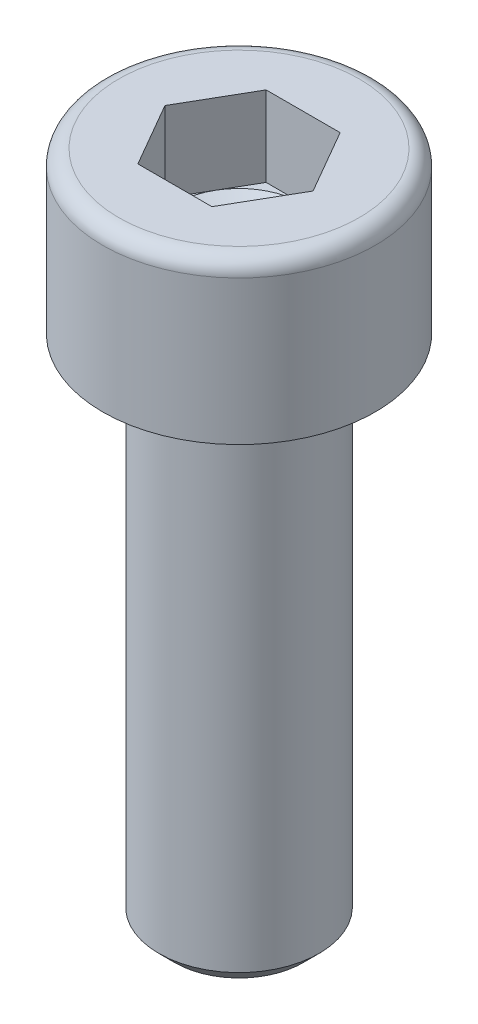
ISO-10303-21;
HEADER;
FILE_DESCRIPTION(('STEP AP214'),'2;1');
FILE_NAME('part.step','',(''),(''),'','','');
FILE_SCHEMA(('AUTOMOTIVE_DESIGN { 1 0 10303 214 1 1 1 1 }'));
ENDSEC;
DATA;
#1=APPLICATION_CONTEXT('core data for automotive mechanical design processes');
#2=APPLICATION_PROTOCOL_DEFINITION('international standard','automotive_design',2000,#1);
#3=PRODUCT_CONTEXT('',#1,'mechanical');
#4=PRODUCT('Part','Part','',(#3));
#5=PRODUCT_RELATED_PRODUCT_CATEGORY('part','',(#4));
#6=PRODUCT_DEFINITION_FORMATION('','',#4);
#7=PRODUCT_DEFINITION_CONTEXT('part definition',#1,'design');
#8=PRODUCT_DEFINITION('design','',#6,#7);
#9=PRODUCT_DEFINITION_SHAPE('','',#8);
#10=(LENGTH_UNIT() NAMED_UNIT(*) SI_UNIT(.MILLI.,.METRE.));
#11=(NAMED_UNIT(*) PLANE_ANGLE_UNIT() SI_UNIT($,.RADIAN.));
#12=(NAMED_UNIT(*) SI_UNIT($,.STERADIAN.) SOLID_ANGLE_UNIT());
#13=UNCERTAINTY_MEASURE_WITH_UNIT(LENGTH_MEASURE(1.E-05),#10,'distance_accuracy_value','');
#14=(GEOMETRIC_REPRESENTATION_CONTEXT(3) GLOBAL_UNCERTAINTY_ASSIGNED_CONTEXT((#13)) GLOBAL_UNIT_ASSIGNED_CONTEXT((#10,
#11,#12)) REPRESENTATION_CONTEXT('',''));
#15=CARTESIAN_POINT('',(0.,0.,0.));
#16=DIRECTION('',(0.,0.,1.));
#17=DIRECTION('',(1.,0.,0.));
#18=AXIS2_PLACEMENT_3D('',#15,#16,#17);
#19=CARTESIAN_POINT('',(0.,-16.,0.));
#20=DIRECTION('',(0.,1.,0.));
#21=DIRECTION('',(0.,0.,1.));
#22=AXIS2_PLACEMENT_3D('',#19,#20,#21);
#23=CYLINDRICAL_SURFACE('',#22,2.5);
#24=CARTESIAN_POINT('',(0.,-15.5,0.));
#25=DIRECTION('',(0.,1.,0.));
#26=DIRECTION('',(0.,0.,1.));
#27=AXIS2_PLACEMENT_3D('',#24,#25,#26);
#28=CIRCLE('',#27,2.5);
#29=CARTESIAN_POINT('',(0.,-15.5,2.5));
#30=VERTEX_POINT('',#29);
#31=EDGE_CURVE('E31',#30,#30,#28,.T.);
#32=ORIENTED_EDGE('',*,*,#31,.T.);
#33=EDGE_LOOP('',(#32));
#34=FACE_BOUND('',#33,.T.);
#35=CARTESIAN_POINT('',(0.,0.,0.));
#36=DIRECTION('',(0.,1.,0.));
#37=DIRECTION('',(0.,0.,1.));
#38=AXIS2_PLACEMENT_3D('',#35,#36,#37);
#39=CIRCLE('',#38,2.5);
#40=CARTESIAN_POINT('',(0.,0.,2.5));
#41=VERTEX_POINT('',#40);
#42=EDGE_CURVE('E142',#41,#41,#39,.T.);
#43=ORIENTED_EDGE('',*,*,#42,.F.);
#44=EDGE_LOOP('',(#43));
#45=FACE_BOUND('',#44,.T.);
#46=ADVANCED_FACE('F24',(#34,#45),#23,.T.);
#47=CARTESIAN_POINT('',(0.,-16.,0.));
#48=DIRECTION('',(0.,1.,0.));
#49=DIRECTION('',(0.,0.,1.));
#50=AXIS2_PLACEMENT_3D('',#47,#48,#49);
#51=PLANE('',#50);
#52=CARTESIAN_POINT('',(0.,-16.,0.));
#53=DIRECTION('',(0.,1.,0.));
#54=DIRECTION('',(0.,0.,1.));
#55=AXIS2_PLACEMENT_3D('',#52,#53,#54);
#56=CIRCLE('',#55,2.);
#57=CARTESIAN_POINT('',(0.,-16.,2.));
#58=VERTEX_POINT('',#57);
#59=EDGE_CURVE('E11',#58,#58,#56,.F.);
#60=ORIENTED_EDGE('',*,*,#59,.T.);
#61=EDGE_LOOP('',(#60));
#62=FACE_BOUND('',#61,.T.);
#63=ADVANCED_FACE('F152',(#62),#51,.F.);
#64=CARTESIAN_POINT('',(0.,-15.5,0.));
#65=DIRECTION('',(0.,1.,0.));
#66=DIRECTION('',(0.,0.,1.));
#67=AXIS2_PLACEMENT_3D('',#64,#65,#66);
#68=CONICAL_SURFACE('',#67,2.5,0.785398163397443);
#69=ORIENTED_EDGE('',*,*,#59,.F.);
#70=EDGE_LOOP('',(#69));
#71=FACE_BOUND('',#70,.T.);
#72=ORIENTED_EDGE('',*,*,#31,.F.);
#73=EDGE_LOOP('',(#72));
#74=FACE_BOUND('',#73,.T.);
#75=ADVANCED_FACE('F149',(#71,#74),#68,.T.);
#76=CARTESIAN_POINT('',(0.,0.,0.));
#77=DIRECTION('',(0.,1.,0.));
#78=DIRECTION('',(0.,0.,1.));
#79=AXIS2_PLACEMENT_3D('',#76,#77,#78);
#80=PLANE('',#79);
#81=ORIENTED_EDGE('',*,*,#42,.T.);
#82=EDGE_LOOP('',(#81));
#83=FACE_BOUND('',#82,.T.);
#84=CARTESIAN_POINT('',(0.,0.,0.));
#85=DIRECTION('',(0.,1.,0.));
#86=DIRECTION('',(0.,0.,1.));
#87=AXIS2_PLACEMENT_3D('',#84,#85,#86);
#88=CIRCLE('',#87,4.25);
#89=CARTESIAN_POINT('',(0.,0.,4.25));
#90=VERTEX_POINT('',#89);
#91=EDGE_CURVE('E139',#90,#90,#88,.T.);
#92=ORIENTED_EDGE('',*,*,#91,.F.);
#93=EDGE_LOOP('',(#92));
#94=FACE_BOUND('',#93,.T.);
#95=ADVANCED_FACE('F151',(#83,#94),#80,.F.);
#96=CARTESIAN_POINT('',(0.,5.,0.));
#97=DIRECTION('',(0.,1.,0.));
#98=DIRECTION('',(0.,0.,1.));
#99=AXIS2_PLACEMENT_3D('',#96,#97,#98);
#100=CYLINDRICAL_SURFACE('',#99,4.25);
#101=CARTESIAN_POINT('',(0.,4.5,0.));
#102=DIRECTION('',(0.,1.,0.));
#103=DIRECTION('',(0.,0.,1.));
#104=AXIS2_PLACEMENT_3D('',#101,#102,#103);
#105=CIRCLE('',#104,4.25);
#106=CARTESIAN_POINT('',(0.,4.5,4.25));
#107=VERTEX_POINT('',#106);
#108=EDGE_CURVE('E136',#107,#107,#105,.T.);
#109=ORIENTED_EDGE('',*,*,#108,.F.);
#110=EDGE_LOOP('',(#109));
#111=FACE_BOUND('',#110,.T.);
#112=ORIENTED_EDGE('',*,*,#91,.T.);
#113=EDGE_LOOP('',(#112));
#114=FACE_BOUND('',#113,.T.);
#115=ADVANCED_FACE('F159',(#111,#114),#100,.T.);
#116=CARTESIAN_POINT('',(0.,4.5,0.));
#117=DIRECTION('',(0.,1.,0.));
#118=DIRECTION('',(0.,0.,1.));
#119=AXIS2_PLACEMENT_3D('',#116,#117,#118);
#120=TOROIDAL_SURFACE('',#119,3.75,0.5);
#121=CARTESIAN_POINT('',(0.,5.,0.));
#122=DIRECTION('',(0.,1.,0.));
#123=DIRECTION('',(0.,0.,1.));
#124=AXIS2_PLACEMENT_3D('',#121,#122,#123);
#125=CIRCLE('',#124,3.75);
#126=CARTESIAN_POINT('',(0.,5.,3.75));
#127=VERTEX_POINT('',#126);
#128=EDGE_CURVE('E131',#127,#127,#125,.T.);
#129=ORIENTED_EDGE('',*,*,#128,.F.);
#130=EDGE_LOOP('',(#129));
#131=FACE_BOUND('',#130,.T.);
#132=ORIENTED_EDGE('',*,*,#108,.T.);
#133=EDGE_LOOP('',(#132));
#134=FACE_BOUND('',#133,.T.);
#135=ADVANCED_FACE('F184',(#131,#134),#120,.T.);
#136=CARTESIAN_POINT('',(2.,5.,0.));
#137=DIRECTION('',(0.,-1.,0.));
#138=DIRECTION('',(0.,0.,-1.));
#139=AXIS2_PLACEMENT_3D('',#136,#137,#138);
#140=PLANE('',#139);
#141=DIRECTION('',(-1.,0.,0.));
#142=VECTOR('',#141,1.);
#143=CARTESIAN_POINT('',(-1.15470053837925,5.,-2.));
#144=LINE('',#143,#142);
#145=CARTESIAN_POINT('',(1.15470053837925,5.,-2.));
#146=VERTEX_POINT('',#145);
#147=CARTESIAN_POINT('',(-1.15470053837925,5.,-2.));
#148=VERTEX_POINT('',#147);
#149=EDGE_CURVE('E38',#146,#148,#144,.T.);
#150=ORIENTED_EDGE('',*,*,#149,.F.);
#151=DIRECTION('',(-0.499999999999998,0.,-0.86602540378444));
#152=VECTOR('',#151,1.);
#153=CARTESIAN_POINT('',(1.15470053837925,5.,-2.));
#154=LINE('',#153,#152);
#155=CARTESIAN_POINT('',(2.3094010767585,5.,0.));
#156=VERTEX_POINT('',#155);
#157=EDGE_CURVE('E115',#156,#146,#154,.T.);
#158=ORIENTED_EDGE('',*,*,#157,.F.);
#159=DIRECTION('',(0.499999999999997,0.,-0.86602540378444));
#160=VECTOR('',#159,1.);
#161=CARTESIAN_POINT('',(1.15470053837925,5.,2.));
#162=LINE('',#161,#160);
#163=CARTESIAN_POINT('',(1.15470053837925,5.,2.));
#164=VERTEX_POINT('',#163);
#165=EDGE_CURVE('E326',#164,#156,#162,.T.);
#166=ORIENTED_EDGE('',*,*,#165,.F.);
#167=DIRECTION('',(1.,0.,0.));
#168=VECTOR('',#167,1.);
#169=CARTESIAN_POINT('',(-1.15470053837925,5.,2.));
#170=LINE('',#169,#168);
#171=CARTESIAN_POINT('',(-1.15470053837925,5.,2.));
#172=VERTEX_POINT('',#171);
#173=EDGE_CURVE('E324',#172,#164,#170,.T.);
#174=ORIENTED_EDGE('',*,*,#173,.F.);
#175=DIRECTION('',(0.499999999999998,0.,0.86602540378444));
#176=VECTOR('',#175,1.);
#177=CARTESIAN_POINT('',(-1.15470053837925,5.,2.));
#178=LINE('',#177,#176);
#179=CARTESIAN_POINT('',(-2.3094010767585,5.,0.));
#180=VERTEX_POINT('',#179);
#181=EDGE_CURVE('E99',#180,#172,#178,.T.);
#182=ORIENTED_EDGE('',*,*,#181,.F.);
#183=DIRECTION('',(-0.499999999999998,0.,0.86602540378444));
#184=VECTOR('',#183,1.);
#185=CARTESIAN_POINT('',(-1.15470053837925,5.,-2.));
#186=LINE('',#185,#184);
#187=EDGE_CURVE('E95',#148,#180,#186,.T.);
#188=ORIENTED_EDGE('',*,*,#187,.F.);
#189=EDGE_LOOP('',(#150,#158,#166,#174,#182,#188));
#190=FACE_BOUND('',#189,.T.);
#191=ORIENTED_EDGE('',*,*,#128,.T.);
#192=EDGE_LOOP('',(#191));
#193=FACE_BOUND('',#192,.T.);
#194=ADVANCED_FACE('F96',(#190,#193),#140,.F.);
#195=CARTESIAN_POINT('',(1.15470053837925,2.5,-2.));
#196=DIRECTION('',(0.86602540378444,0.,-0.499999999999998));
#197=DIRECTION('',(-0.499999999999998,0.,-0.86602540378444));
#198=AXIS2_PLACEMENT_3D('',#195,#196,#197);
#199=PLANE('',#198);
#200=ORIENTED_EDGE('',*,*,#157,.T.);
#201=DIRECTION('',(0.,1.,0.));
#202=VECTOR('',#201,1.);
#203=CARTESIAN_POINT('',(1.15470053837925,2.5,-2.));
#204=LINE('',#203,#202);
#205=CARTESIAN_POINT('',(1.15470053837925,2.5,-2.));
#206=VERTEX_POINT('',#205);
#207=EDGE_CURVE('E113',#206,#146,#204,.T.);
#208=ORIENTED_EDGE('',*,*,#207,.F.);
#209=DIRECTION('',(-0.499999999999998,0.,-0.86602540378444));
#210=VECTOR('',#209,1.);
#211=CARTESIAN_POINT('',(1.15470053837925,2.5,-2.));
#212=LINE('',#211,#210);
#213=CARTESIAN_POINT('',(1.73205080756888,2.5,-0.999999999999995));
#214=VERTEX_POINT('',#213);
#215=EDGE_CURVE('E328',#214,#206,#212,.T.);
#216=ORIENTED_EDGE('',*,*,#215,.F.);
#217=CARTESIAN_POINT('',(2.3094010767585,2.5,0.));
#218=VERTEX_POINT('',#217);
#219=EDGE_CURVE('E332',#218,#214,#212,.T.);
#220=ORIENTED_EDGE('',*,*,#219,.F.);
#221=DIRECTION('',(0.,1.,0.));
#222=VECTOR('',#221,1.);
#223=CARTESIAN_POINT('',(2.3094010767585,2.5,0.));
#224=LINE('',#223,#222);
#225=EDGE_CURVE('E316',#218,#156,#224,.T.);
#226=ORIENTED_EDGE('',*,*,#225,.T.);
#227=EDGE_LOOP('',(#200,#208,#216,#220,#226));
#228=FACE_BOUND('',#227,.T.);
#229=ADVANCED_FACE('F199',(#228),#199,.F.);
#230=CARTESIAN_POINT('',(1.15470053837925,2.5,2.));
#231=DIRECTION('',(0.86602540378444,0.,0.499999999999998));
#232=DIRECTION('',(0.499999999999998,0.,-0.86602540378444));
#233=AXIS2_PLACEMENT_3D('',#230,#231,#232);
#234=PLANE('',#233);
#235=ORIENTED_EDGE('',*,*,#165,.T.);
#236=ORIENTED_EDGE('',*,*,#225,.F.);
#237=DIRECTION('',(0.499999999999997,0.,-0.86602540378444));
#238=VECTOR('',#237,1.);
#239=CARTESIAN_POINT('',(1.15470053837925,2.5,2.));
#240=LINE('',#239,#238);
#241=CARTESIAN_POINT('',(1.73205080756888,2.5,0.999999999999995));
#242=VERTEX_POINT('',#241);
#243=EDGE_CURVE('E312',#242,#218,#240,.T.);
#244=ORIENTED_EDGE('',*,*,#243,.F.);
#245=CARTESIAN_POINT('',(1.15470053837925,2.5,2.));
#246=VERTEX_POINT('',#245);
#247=EDGE_CURVE('E46',#246,#242,#240,.T.);
#248=ORIENTED_EDGE('',*,*,#247,.F.);
#249=DIRECTION('',(0.,1.,0.));
#250=VECTOR('',#249,1.);
#251=CARTESIAN_POINT('',(1.15470053837925,2.5,2.));
#252=LINE('',#251,#250);
#253=EDGE_CURVE('E306',#246,#164,#252,.T.);
#254=ORIENTED_EDGE('',*,*,#253,.T.);
#255=EDGE_LOOP('',(#235,#236,#244,#248,#254));
#256=FACE_BOUND('',#255,.T.);
#257=ADVANCED_FACE('F216',(#256),#234,.F.);
#258=CARTESIAN_POINT('',(-1.15470053837925,2.5,2.));
#259=DIRECTION('',(0.,0.,1.));
#260=DIRECTION('',(1.,0.,0.));
#261=AXIS2_PLACEMENT_3D('',#258,#259,#260);
#262=PLANE('',#261);
#263=ORIENTED_EDGE('',*,*,#173,.T.);
#264=ORIENTED_EDGE('',*,*,#253,.F.);
#265=DIRECTION('',(1.,0.,0.));
#266=VECTOR('',#265,1.);
#267=CARTESIAN_POINT('',(-1.15470053837925,2.5,2.));
#268=LINE('',#267,#266);
#269=CARTESIAN_POINT('',(0.,2.5,2.));
#270=VERTEX_POINT('',#269);
#271=EDGE_CURVE('E295',#270,#246,#268,.T.);
#272=ORIENTED_EDGE('',*,*,#271,.F.);
#273=CARTESIAN_POINT('',(-1.15470053837925,2.5,2.));
#274=VERTEX_POINT('',#273);
#275=EDGE_CURVE('E304',#274,#270,#268,.T.);
#276=ORIENTED_EDGE('',*,*,#275,.F.);
#277=DIRECTION('',(0.,1.,0.));
#278=VECTOR('',#277,1.);
#279=CARTESIAN_POINT('',(-1.15470053837925,2.5,2.));
#280=LINE('',#279,#278);
#281=EDGE_CURVE('E123',#274,#172,#280,.T.);
#282=ORIENTED_EDGE('',*,*,#281,.T.);
#283=EDGE_LOOP('',(#263,#264,#272,#276,#282));
#284=FACE_BOUND('',#283,.T.);
#285=ADVANCED_FACE('F224',(#284),#262,.F.);
#286=CARTESIAN_POINT('',(-1.15470053837925,2.5,2.));
#287=DIRECTION('',(-0.86602540378444,0.,0.499999999999998));
#288=DIRECTION('',(0.499999999999998,0.,0.86602540378444));
#289=AXIS2_PLACEMENT_3D('',#286,#287,#288);
#290=PLANE('',#289);
#291=ORIENTED_EDGE('',*,*,#181,.T.);
#292=ORIENTED_EDGE('',*,*,#281,.F.);
#293=DIRECTION('',(0.499999999999998,0.,0.86602540378444));
#294=VECTOR('',#293,1.);
#295=CARTESIAN_POINT('',(-1.15470053837925,2.5,2.));
#296=LINE('',#295,#294);
#297=CARTESIAN_POINT('',(-1.73205080756888,2.5,0.999999999999995));
#298=VERTEX_POINT('',#297);
#299=EDGE_CURVE('E310',#298,#274,#296,.T.);
#300=ORIENTED_EDGE('',*,*,#299,.F.);
#301=CARTESIAN_POINT('',(-2.3094010767585,2.5,0.));
#302=VERTEX_POINT('',#301);
#303=EDGE_CURVE('E307',#302,#298,#296,.T.);
#304=ORIENTED_EDGE('',*,*,#303,.F.);
#305=DIRECTION('',(0.,1.,0.));
#306=VECTOR('',#305,1.);
#307=CARTESIAN_POINT('',(-2.3094010767585,2.5,0.));
#308=LINE('',#307,#306);
#309=EDGE_CURVE('E121',#302,#180,#308,.T.);
#310=ORIENTED_EDGE('',*,*,#309,.T.);
#311=EDGE_LOOP('',(#291,#292,#300,#304,#310));
#312=FACE_BOUND('',#311,.T.);
#313=ADVANCED_FACE('F232',(#312),#290,.F.);
#314=CARTESIAN_POINT('',(-1.15470053837925,2.5,-2.));
#315=DIRECTION('',(-0.86602540378444,0.,-0.499999999999998));
#316=DIRECTION('',(-0.499999999999998,0.,0.86602540378444));
#317=AXIS2_PLACEMENT_3D('',#314,#315,#316);
#318=PLANE('',#317);
#319=ORIENTED_EDGE('',*,*,#187,.T.);
#320=ORIENTED_EDGE('',*,*,#309,.F.);
#321=DIRECTION('',(-0.499999999999998,0.,0.86602540378444));
#322=VECTOR('',#321,1.);
#323=CARTESIAN_POINT('',(-1.15470053837925,2.5,-2.));
#324=LINE('',#323,#322);
#325=CARTESIAN_POINT('',(-1.73205080756888,2.5,-0.999999999999995));
#326=VERTEX_POINT('',#325);
#327=EDGE_CURVE('E339',#326,#302,#324,.T.);
#328=ORIENTED_EDGE('',*,*,#327,.F.);
#329=CARTESIAN_POINT('',(-1.15470053837925,2.5,-2.));
#330=VERTEX_POINT('',#329);
#331=EDGE_CURVE('E120',#330,#326,#324,.T.);
#332=ORIENTED_EDGE('',*,*,#331,.F.);
#333=DIRECTION('',(0.,1.,0.));
#334=VECTOR('',#333,1.);
#335=CARTESIAN_POINT('',(-1.15470053837925,2.5,-2.));
#336=LINE('',#335,#334);
#337=EDGE_CURVE('E109',#330,#148,#336,.T.);
#338=ORIENTED_EDGE('',*,*,#337,.T.);
#339=EDGE_LOOP('',(#319,#320,#328,#332,#338));
#340=FACE_BOUND('',#339,.T.);
#341=ADVANCED_FACE('F117',(#340),#318,.F.);
#342=CARTESIAN_POINT('',(-1.15470053837925,2.5,-2.));
#343=DIRECTION('',(0.,0.,-1.));
#344=DIRECTION('',(-1.,0.,0.));
#345=AXIS2_PLACEMENT_3D('',#342,#343,#344);
#346=PLANE('',#345);
#347=ORIENTED_EDGE('',*,*,#149,.T.);
#348=ORIENTED_EDGE('',*,*,#337,.F.);
#349=DIRECTION('',(-1.,0.,0.));
#350=VECTOR('',#349,1.);
#351=CARTESIAN_POINT('',(-1.15470053837925,2.5,-2.));
#352=LINE('',#351,#350);
#353=CARTESIAN_POINT('',(0.,2.5,-2.));
#354=VERTEX_POINT('',#353);
#355=EDGE_CURVE('E335',#354,#330,#352,.T.);
#356=ORIENTED_EDGE('',*,*,#355,.F.);
#357=EDGE_CURVE('E336',#206,#354,#352,.T.);
#358=ORIENTED_EDGE('',*,*,#357,.F.);
#359=ORIENTED_EDGE('',*,*,#207,.T.);
#360=EDGE_LOOP('',(#347,#348,#356,#358,#359));
#361=FACE_BOUND('',#360,.T.);
#362=ADVANCED_FACE('F107',(#361),#346,.F.);
#363=CARTESIAN_POINT('',(3.46410161513774,2.5,2.));
#364=DIRECTION('',(0.,1.,0.));
#365=DIRECTION('',(0.,0.,1.));
#366=AXIS2_PLACEMENT_3D('',#363,#364,#365);
#367=PLANE('',#366);
#368=CARTESIAN_POINT('',(0.,2.5,0.));
#369=DIRECTION('',(0.,1.,0.));
#370=DIRECTION('',(0.,0.,1.));
#371=AXIS2_PLACEMENT_3D('',#368,#369,#370);
#372=CIRCLE('',#371,2.);
#373=EDGE_CURVE('E133',#298,#270,#372,.T.);
#374=ORIENTED_EDGE('',*,*,#373,.F.);
#375=ORIENTED_EDGE('',*,*,#299,.T.);
#376=ORIENTED_EDGE('',*,*,#275,.T.);
#377=EDGE_LOOP('',(#374,#375,#376));
#378=FACE_BOUND('',#377,.T.);
#379=ADVANCED_FACE('F253',(#378),#367,.T.);
#380=EDGE_CURVE('E315',#326,#298,#372,.T.);
#381=ORIENTED_EDGE('',*,*,#380,.F.);
#382=ORIENTED_EDGE('',*,*,#327,.T.);
#383=ORIENTED_EDGE('',*,*,#303,.T.);
#384=EDGE_LOOP('',(#381,#382,#383));
#385=FACE_BOUND('',#384,.T.);
#386=ADVANCED_FACE('F260',(#385),#367,.T.);
#387=EDGE_CURVE('E317',#354,#326,#372,.T.);
#388=ORIENTED_EDGE('',*,*,#387,.F.);
#389=ORIENTED_EDGE('',*,*,#355,.T.);
#390=ORIENTED_EDGE('',*,*,#331,.T.);
#391=EDGE_LOOP('',(#388,#389,#390));
#392=FACE_BOUND('',#391,.T.);
#393=ADVANCED_FACE('F268',(#392),#367,.T.);
#394=EDGE_CURVE('E344',#214,#354,#372,.T.);
#395=ORIENTED_EDGE('',*,*,#394,.F.);
#396=ORIENTED_EDGE('',*,*,#215,.T.);
#397=ORIENTED_EDGE('',*,*,#357,.T.);
#398=EDGE_LOOP('',(#395,#396,#397));
#399=FACE_BOUND('',#398,.T.);
#400=ADVANCED_FACE('F275',(#399),#367,.T.);
#401=EDGE_CURVE('E132',#242,#214,#372,.T.);
#402=ORIENTED_EDGE('',*,*,#401,.F.);
#403=ORIENTED_EDGE('',*,*,#243,.T.);
#404=ORIENTED_EDGE('',*,*,#219,.T.);
#405=EDGE_LOOP('',(#402,#403,#404));
#406=FACE_BOUND('',#405,.T.);
#407=ADVANCED_FACE('F282',(#406),#367,.T.);
#408=EDGE_CURVE('E128',#270,#242,#372,.T.);
#409=ORIENTED_EDGE('',*,*,#408,.F.);
#410=ORIENTED_EDGE('',*,*,#271,.T.);
#411=ORIENTED_EDGE('',*,*,#247,.T.);
#412=EDGE_LOOP('',(#409,#410,#411));
#413=FACE_BOUND('',#412,.T.);
#414=ADVANCED_FACE('F208',(#413),#367,.T.);
#415=CARTESIAN_POINT('',(0.,2.5,0.));
#416=DIRECTION('',(0.,1.,0.));
#417=DIRECTION('',(0.,0.,1.));
#418=AXIS2_PLACEMENT_3D('',#415,#416,#417);
#419=CONICAL_SURFACE('',#418,2.,1.04719755119659);
#420=CARTESIAN_POINT('',(0.,1.34529946162074,0.));
#421=VERTEX_POINT('',#420);
#422=VERTEX_LOOP('',#421);
#423=FACE_BOUND('',#422,.T.);
#424=ORIENTED_EDGE('',*,*,#408,.T.);
#425=ORIENTED_EDGE('',*,*,#401,.T.);
#426=ORIENTED_EDGE('',*,*,#394,.T.);
#427=ORIENTED_EDGE('',*,*,#387,.T.);
#428=ORIENTED_EDGE('',*,*,#380,.T.);
#429=ORIENTED_EDGE('',*,*,#373,.T.);
#430=EDGE_LOOP('',(#424,#425,#426,#427,#428,#429));
#431=FACE_BOUND('',#430,.T.);
#432=ADVANCED_FACE('F203',(#423,#431),#419,.F.);
#433=CLOSED_SHELL('',(#46,#63,#75,#95,#115,#135,#194,#229,#257,#285,#313,#341,#362,#379,#386,
#393,#400,#407,#414,#432));
#434=MANIFOLD_SOLID_BREP('B2',#433);
#435=ADVANCED_BREP_SHAPE_REPRESENTATION('',(#18,#434),#14);
#436=SHAPE_DEFINITION_REPRESENTATION(#9,#435);
ENDSEC;
END-ISO-10303-21;
